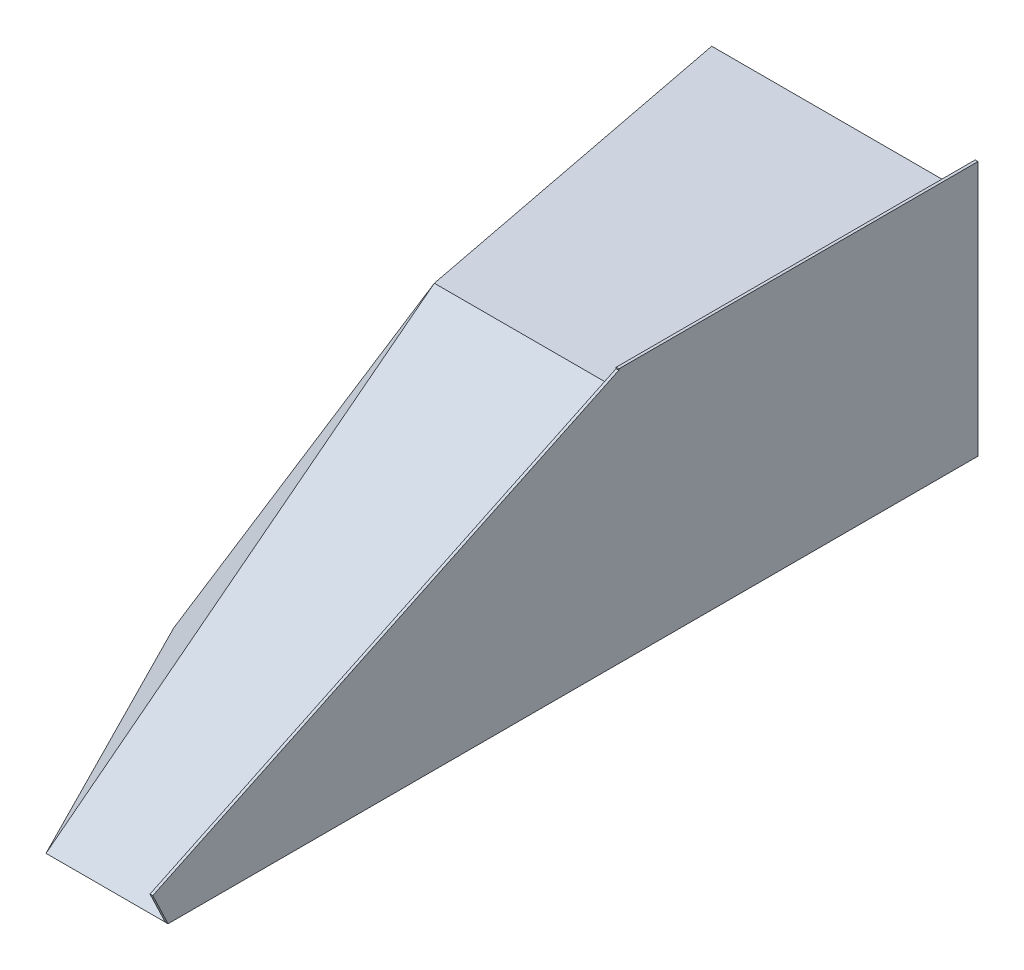
ISO-10303-21;
HEADER;
FILE_DESCRIPTION(('STEP AP214'),'2;1');
FILE_NAME('part.step','',(''),(''),'','','');
FILE_SCHEMA(('AUTOMOTIVE_DESIGN { 1 0 10303 214 1 1 1 1 }'));
ENDSEC;
DATA;
#1=APPLICATION_CONTEXT('core data for automotive mechanical design processes');
#2=APPLICATION_PROTOCOL_DEFINITION('international standard','automotive_design',2000,#1);
#3=PRODUCT_CONTEXT('',#1,'mechanical');
#4=PRODUCT('Part','Part','',(#3));
#5=PRODUCT_RELATED_PRODUCT_CATEGORY('part','',(#4));
#6=PRODUCT_DEFINITION_FORMATION('','',#4);
#7=PRODUCT_DEFINITION_CONTEXT('part definition',#1,'design');
#8=PRODUCT_DEFINITION('design','',#6,#7);
#9=PRODUCT_DEFINITION_SHAPE('','',#8);
#10=(LENGTH_UNIT() NAMED_UNIT(*) SI_UNIT(.MILLI.,.METRE.));
#11=(NAMED_UNIT(*) PLANE_ANGLE_UNIT() SI_UNIT($,.RADIAN.));
#12=(NAMED_UNIT(*) SI_UNIT($,.STERADIAN.) SOLID_ANGLE_UNIT());
#13=UNCERTAINTY_MEASURE_WITH_UNIT(LENGTH_MEASURE(1.E-05),#10,'distance_accuracy_value','');
#14=(GEOMETRIC_REPRESENTATION_CONTEXT(3) GLOBAL_UNCERTAINTY_ASSIGNED_CONTEXT((#13)) GLOBAL_UNIT_ASSIGNED_CONTEXT((#10,
#11,#12)) REPRESENTATION_CONTEXT('',''));
#15=CARTESIAN_POINT('',(0.,0.,0.));
#16=DIRECTION('',(0.,0.,1.));
#17=DIRECTION('',(1.,0.,0.));
#18=AXIS2_PLACEMENT_3D('',#15,#16,#17);
#19=CARTESIAN_POINT('',(508.,0.,0.));
#20=DIRECTION('',(0.,-0.90286051882393,-0.429933580392348));
#21=DIRECTION('',(0.,0.429933580392348,-0.90286051882393));
#22=AXIS2_PLACEMENT_3D('',#19,#20,#21);
#23=PLANE('',#22);
#24=DIRECTION('',(0.,-0.429933580392348,0.90286051882393));
#25=VECTOR('',#24,1.);
#26=CARTESIAN_POINT('',(-6.34999999999999,0.,0.));
#27=LINE('',#26,#25);
#28=CARTESIAN_POINT('',(-6.34999999999999,508.,-1066.8));
#29=VERTEX_POINT('',#28);
#30=CARTESIAN_POINT('',(-6.34999999999999,0.,0.));
#31=VERTEX_POINT('',#30);
#32=EDGE_CURVE('E236',#29,#31,#27,.T.);
#33=ORIENTED_EDGE('',*,*,#32,.F.);
#34=DIRECTION('',(-1.,0.,0.));
#35=VECTOR('',#34,1.);
#36=CARTESIAN_POINT('',(457.2,508.,-1066.8));
#37=LINE('',#36,#35);
#38=CARTESIAN_POINT('',(-457.2,508.,-1066.8));
#39=VERTEX_POINT('',#38);
#40=EDGE_CURVE('E11',#29,#39,#37,.T.);
#41=ORIENTED_EDGE('',*,*,#40,.T.);
#42=DIRECTION('',(0.148801508186848,-0.425147166248136,0.892809049121087));
#43=VECTOR('',#42,1.);
#44=CARTESIAN_POINT('',(-311.537370085856,91.8210573881609,-192.824220515138));
#45=LINE('',#44,#43);
#46=CARTESIAN_POINT('',(-279.4,0.,0.));
#47=VERTEX_POINT('',#46);
#48=EDGE_CURVE('E206',#39,#47,#45,.T.);
#49=ORIENTED_EDGE('',*,*,#48,.T.);
#50=DIRECTION('',(1.,0.,0.));
#51=VECTOR('',#50,1.);
#52=CARTESIAN_POINT('',(0.,0.,0.));
#53=LINE('',#52,#51);
#54=EDGE_CURVE('E43',#47,#31,#53,.T.);
#55=ORIENTED_EDGE('',*,*,#54,.T.);
#56=EDGE_LOOP('',(#33,#41,#49,#55));
#57=FACE_BOUND('',#56,.T.);
#58=ADVANCED_FACE('F39',(#57),#23,.F.);
#59=CARTESIAN_POINT('',(0.,584.2,-1032.08576463712));
#60=DIRECTION('',(0.,0.,-1.));
#61=DIRECTION('',(-1.,0.,0.));
#62=AXIS2_PLACEMENT_3D('',#59,#60,#61);
#63=PLANE('',#62);
#64=DIRECTION('',(-1.,0.,0.));
#65=VECTOR('',#64,1.);
#66=CARTESIAN_POINT('',(0.,580.899894262055,-1032.08576463712));
#67=LINE('',#66,#65);
#68=CARTESIAN_POINT('',(0.,580.899894262055,-1032.08576463712));
#69=VERTEX_POINT('',#68);
#70=CARTESIAN_POINT('',(-6.35,580.899894262055,-1032.08576463712));
#71=VERTEX_POINT('',#70);
#72=EDGE_CURVE('E146',#69,#71,#67,.T.);
#73=ORIENTED_EDGE('',*,*,#72,.F.);
#74=DIRECTION('',(0.,-1.,0.));
#75=VECTOR('',#74,1.);
#76=CARTESIAN_POINT('',(0.,584.2,-1032.08576463712));
#77=LINE('',#76,#75);
#78=CARTESIAN_POINT('',(0.,584.2,-1032.08576463712));
#79=VERTEX_POINT('',#78);
#80=EDGE_CURVE('E144',#79,#69,#77,.T.);
#81=ORIENTED_EDGE('',*,*,#80,.F.);
#82=DIRECTION('',(1.,0.,0.));
#83=VECTOR('',#82,1.);
#84=CARTESIAN_POINT('',(0.,584.2,-1032.08576463712));
#85=LINE('',#84,#83);
#86=CARTESIAN_POINT('',(-6.34999999999997,584.2,-1032.08576463712));
#87=VERTEX_POINT('',#86);
#88=EDGE_CURVE('E165',#87,#79,#85,.T.);
#89=ORIENTED_EDGE('',*,*,#88,.F.);
#90=DIRECTION('',(0.,-1.,0.));
#91=VECTOR('',#90,1.);
#92=CARTESIAN_POINT('',(-6.34999999999997,584.2,-1032.08576463712));
#93=LINE('',#92,#91);
#94=EDGE_CURVE('E172',#87,#71,#93,.T.);
#95=ORIENTED_EDGE('',*,*,#94,.T.);
#96=EDGE_LOOP('',(#73,#81,#89,#95));
#97=FACE_BOUND('',#96,.T.);
#98=ADVANCED_FACE('F254',(#97),#63,.F.);
#99=CARTESIAN_POINT('',(0.,508.,0.));
#100=DIRECTION('',(0.,-1.,0.));
#101=DIRECTION('',(0.,0.,-1.));
#102=AXIS2_PLACEMENT_3D('',#99,#100,#101);
#103=PLANE('',#102);
#104=DIRECTION('',(0.,0.,1.));
#105=VECTOR('',#104,1.);
#106=CARTESIAN_POINT('',(-6.34999999999997,508.,-1032.08576463712));
#107=LINE('',#106,#105);
#108=CARTESIAN_POINT('',(-6.35000000000004,508.,-1854.2));
#109=VERTEX_POINT('',#108);
#110=EDGE_CURVE('E55',#109,#29,#107,.T.);
#111=ORIENTED_EDGE('',*,*,#110,.F.);
#112=DIRECTION('',(1.,0.,0.));
#113=VECTOR('',#112,1.);
#114=CARTESIAN_POINT('',(0.,508.,-1854.2));
#115=LINE('',#114,#113);
#116=CARTESIAN_POINT('',(-609.6,508.,-1854.2));
#117=VERTEX_POINT('',#116);
#118=EDGE_CURVE('E210',#117,#109,#115,.T.);
#119=ORIENTED_EDGE('',*,*,#118,.F.);
#120=DIRECTION('',(0.190021906565861,0.,0.981779850590281));
#121=VECTOR('',#120,1.);
#122=CARTESIAN_POINT('',(-609.6,508.,-1854.2));
#123=LINE('',#122,#121);
#124=EDGE_CURVE('E202',#117,#39,#123,.T.);
#125=ORIENTED_EDGE('',*,*,#124,.T.);
#126=ORIENTED_EDGE('',*,*,#40,.F.);
#127=EDGE_LOOP('',(#111,#119,#125,#126));
#128=FACE_BOUND('',#127,.T.);
#129=ADVANCED_FACE('F258',(#128),#103,.F.);
#130=CARTESIAN_POINT('',(0.,0.,0.));
#131=DIRECTION('',(0.,1.,0.));
#132=DIRECTION('',(0.,0.,1.));
#133=AXIS2_PLACEMENT_3D('',#130,#131,#132);
#134=PLANE('',#133);
#135=DIRECTION('',(1.,0.,0.));
#136=VECTOR('',#135,1.);
#137=CARTESIAN_POINT('',(0.,0.,-1854.2));
#138=LINE('',#137,#136);
#139=CARTESIAN_POINT('',(-824.163316723663,0.,-1854.2));
#140=VERTEX_POINT('',#139);
#141=CARTESIAN_POINT('',(0.,0.,-1854.2));
#142=VERTEX_POINT('',#141);
#143=EDGE_CURVE('E209',#140,#142,#138,.T.);
#144=ORIENTED_EDGE('',*,*,#143,.T.);
#145=DIRECTION('',(0.,0.,1.));
#146=VECTOR('',#145,1.);
#147=CARTESIAN_POINT('',(0.,0.,0.));
#148=LINE('',#147,#146);
#149=CARTESIAN_POINT('',(0.,0.,0.));
#150=VERTEX_POINT('',#149);
#151=EDGE_CURVE('E183',#142,#150,#148,.T.);
#152=ORIENTED_EDGE('',*,*,#151,.T.);
#153=DIRECTION('',(1.,0.,0.));
#154=VECTOR('',#153,1.);
#155=CARTESIAN_POINT('',(0.,0.,0.));
#156=LINE('',#155,#154);
#157=EDGE_CURVE('E138',#31,#150,#156,.T.);
#158=ORIENTED_EDGE('',*,*,#157,.F.);
#159=ORIENTED_EDGE('',*,*,#54,.F.);
#160=DIRECTION('',(0.452240599485052,0.,0.891895980581481));
#161=VECTOR('',#160,1.);
#162=CARTESIAN_POINT('',(-279.4,0.,0.));
#163=LINE('',#162,#161);
#164=CARTESIAN_POINT('',(-580.045451773785,0.,-592.924364425635));
#165=VERTEX_POINT('',#164);
#166=EDGE_CURVE('E199',#165,#47,#163,.T.);
#167=ORIENTED_EDGE('',*,*,#166,.F.);
#168=DIRECTION('',(-0.190021906565861,0.,-0.981779850590281));
#169=VECTOR('',#168,1.);
#170=CARTESIAN_POINT('',(-448.48520298038,0.,86.8035876736221));
#171=LINE('',#170,#169);
#172=EDGE_CURVE('E191',#165,#140,#171,.T.);
#173=ORIENTED_EDGE('',*,*,#172,.T.);
#174=EDGE_LOOP('',(#144,#152,#158,#159,#167,#173));
#175=FACE_BOUND('',#174,.T.);
#176=ADVANCED_FACE('F41',(#175),#134,.F.);
#177=CARTESIAN_POINT('',(0.,508.,-1854.2));
#178=DIRECTION('',(0.,0.,-1.));
#179=DIRECTION('',(-1.,0.,0.));
#180=AXIS2_PLACEMENT_3D('',#177,#178,#179);
#181=PLANE('',#180);
#182=DIRECTION('',(0.,1.,0.));
#183=VECTOR('',#182,1.);
#184=CARTESIAN_POINT('',(0.,508.,-1854.2));
#185=LINE('',#184,#183);
#186=CARTESIAN_POINT('',(0.,584.2,-1854.2));
#187=VERTEX_POINT('',#186);
#188=EDGE_CURVE('E180',#142,#187,#185,.T.);
#189=ORIENTED_EDGE('',*,*,#188,.F.);
#190=ORIENTED_EDGE('',*,*,#143,.F.);
#191=DIRECTION('',(0.389086580250754,0.921201190331826,0.));
#192=VECTOR('',#191,1.);
#193=CARTESIAN_POINT('',(-596.562158471762,538.868386998671,-1854.2));
#194=LINE('',#193,#192);
#195=EDGE_CURVE('E195',#140,#117,#194,.T.);
#196=ORIENTED_EDGE('',*,*,#195,.T.);
#197=ORIENTED_EDGE('',*,*,#118,.T.);
#198=DIRECTION('',(0.,-1.,0.));
#199=VECTOR('',#198,1.);
#200=CARTESIAN_POINT('',(-6.35000000000011,584.2,-1854.2));
#201=LINE('',#200,#199);
#202=CARTESIAN_POINT('',(-6.35000000000011,584.2,-1854.2));
#203=VERTEX_POINT('',#202);
#204=EDGE_CURVE('E176',#203,#109,#201,.T.);
#205=ORIENTED_EDGE('',*,*,#204,.F.);
#206=DIRECTION('',(-1.,0.,0.));
#207=VECTOR('',#206,1.);
#208=CARTESIAN_POINT('',(0.,584.2,-1854.2));
#209=LINE('',#208,#207);
#210=EDGE_CURVE('E159',#187,#203,#209,.T.);
#211=ORIENTED_EDGE('',*,*,#210,.F.);
#212=EDGE_LOOP('',(#189,#190,#196,#197,#205,#211));
#213=FACE_BOUND('',#212,.T.);
#214=ADVANCED_FACE('F222',(#213),#181,.T.);
#215=CARTESIAN_POINT('',(-158.02566362996,112.959299077336,80.1277530227725));
#216=DIRECTION('',(0.752056744720598,-0.537582319217142,-0.381334371366358));
#217=DIRECTION('',(-0.581523906275312,-0.813529315040523,0.));
#218=AXIS2_PLACEMENT_3D('',#215,#216,#217);
#219=PLANE('',#218);
#220=ORIENTED_EDGE('',*,*,#166,.T.);
#221=ORIENTED_EDGE('',*,*,#48,.F.);
#222=DIRECTION('',(0.174128370510824,0.720069086337755,-0.671699204617629));
#223=VECTOR('',#222,1.);
#224=CARTESIAN_POINT('',(-631.807626871652,-214.050944255857,-393.252066680483));
#225=LINE('',#224,#223);
#226=EDGE_CURVE('E187',#165,#39,#225,.T.);
#227=ORIENTED_EDGE('',*,*,#226,.F.);
#228=EDGE_LOOP('',(#220,#221,#227));
#229=FACE_BOUND('',#228,.T.);
#230=ADVANCED_FACE('F264',(#229),#219,.F.);
#231=CARTESIAN_POINT('',(-382.681643927251,161.632761358848,74.0674149536616));
#232=DIRECTION('',(0.906898890852564,-0.383045736130585,-0.175528817584368));
#233=DIRECTION('',(-0.389086580250754,-0.921201190331826,0.));
#234=AXIS2_PLACEMENT_3D('',#231,#232,#233);
#235=PLANE('',#234);
#236=ORIENTED_EDGE('',*,*,#195,.F.);
#237=ORIENTED_EDGE('',*,*,#172,.F.);
#238=ORIENTED_EDGE('',*,*,#226,.T.);
#239=ORIENTED_EDGE('',*,*,#124,.F.);
#240=EDGE_LOOP('',(#236,#237,#238,#239));
#241=FACE_BOUND('',#240,.T.);
#242=ADVANCED_FACE('F269',(#241),#235,.F.);
#243=CARTESIAN_POINT('',(0.,0.,0.));
#244=DIRECTION('',(-1.,0.,0.));
#245=DIRECTION('',(0.,0.,1.));
#246=AXIS2_PLACEMENT_3D('',#243,#244,#245);
#247=PLANE('',#246);
#248=ORIENTED_EDGE('',*,*,#80,.T.);
#249=DIRECTION('',(0.,-0.90286051882393,-0.429933580392348));
#250=VECTOR('',#249,1.);
#251=CARTESIAN_POINT('',(0.,581.384502970009,-1031.85499858571));
#252=LINE('',#251,#250);
#253=CARTESIAN_POINT('',(0.,581.384502970009,-1031.85499858571));
#254=VERTEX_POINT('',#253);
#255=EDGE_CURVE('E120',#254,#69,#252,.T.);
#256=ORIENTED_EDGE('',*,*,#255,.F.);
#257=DIRECTION('',(0.,0.429933580392348,-0.90286051882393));
#258=VECTOR('',#257,1.);
#259=CARTESIAN_POINT('',(0.,73.3845029700091,34.94500141429));
#260=LINE('',#259,#258);
#261=CARTESIAN_POINT('',(0.,73.3845029700091,34.94500141429));
#262=VERTEX_POINT('',#261);
#263=EDGE_CURVE('E128',#262,#254,#260,.T.);
#264=ORIENTED_EDGE('',*,*,#263,.F.);
#265=DIRECTION('',(0.,-0.90286051882393,-0.429933580392348));
#266=VECTOR('',#265,1.);
#267=CARTESIAN_POINT('',(0.,73.3845029700091,34.94500141429));
#268=LINE('',#267,#266);
#269=EDGE_CURVE('E225',#262,#150,#268,.T.);
#270=ORIENTED_EDGE('',*,*,#269,.T.);
#271=ORIENTED_EDGE('',*,*,#151,.F.);
#272=ORIENTED_EDGE('',*,*,#188,.T.);
#273=DIRECTION('',(0.,0.,-1.));
#274=VECTOR('',#273,1.);
#275=CARTESIAN_POINT('',(0.,584.2,-1032.08576463712));
#276=LINE('',#275,#274);
#277=EDGE_CURVE('E155',#79,#187,#276,.T.);
#278=ORIENTED_EDGE('',*,*,#277,.F.);
#279=EDGE_LOOP('',(#248,#256,#264,#270,#271,#272,#278));
#280=FACE_BOUND('',#279,.T.);
#281=ADVANCED_FACE('F141',(#280),#247,.F.);
#282=CARTESIAN_POINT('',(-6.34999999999997,584.2,-1032.08576463712));
#283=DIRECTION('',(1.,0.,0.));
#284=DIRECTION('',(0.,0.,-1.));
#285=AXIS2_PLACEMENT_3D('',#282,#283,#284);
#286=PLANE('',#285);
#287=DIRECTION('',(0.,-0.90286051882393,-0.429933580392348));
#288=VECTOR('',#287,1.);
#289=CARTESIAN_POINT('',(-6.35,581.384502970009,-1031.85499858571));
#290=LINE('',#289,#288);
#291=CARTESIAN_POINT('',(-6.35,581.384502970009,-1031.85499858571));
#292=VERTEX_POINT('',#291);
#293=EDGE_CURVE('E123',#292,#71,#290,.T.);
#294=ORIENTED_EDGE('',*,*,#293,.T.);
#295=ORIENTED_EDGE('',*,*,#94,.F.);
#296=DIRECTION('',(0.,0.,1.));
#297=VECTOR('',#296,1.);
#298=CARTESIAN_POINT('',(-6.34999999999997,584.2,-1032.08576463712));
#299=LINE('',#298,#297);
#300=EDGE_CURVE('E162',#203,#87,#299,.T.);
#301=ORIENTED_EDGE('',*,*,#300,.F.);
#302=ORIENTED_EDGE('',*,*,#204,.T.);
#303=ORIENTED_EDGE('',*,*,#110,.T.);
#304=ORIENTED_EDGE('',*,*,#32,.T.);
#305=DIRECTION('',(0.,-0.90286051882393,-0.429933580392348));
#306=VECTOR('',#305,1.);
#307=CARTESIAN_POINT('',(-6.35,73.3845029700091,34.94500141429));
#308=LINE('',#307,#306);
#309=CARTESIAN_POINT('',(-6.35,73.3845029700091,34.94500141429));
#310=VERTEX_POINT('',#309);
#311=EDGE_CURVE('E151',#310,#31,#308,.T.);
#312=ORIENTED_EDGE('',*,*,#311,.F.);
#313=DIRECTION('',(0.,-0.429933580392348,0.90286051882393));
#314=VECTOR('',#313,1.);
#315=CARTESIAN_POINT('',(-6.35,73.3845029700091,34.94500141429));
#316=LINE('',#315,#314);
#317=EDGE_CURVE('E127',#292,#310,#316,.T.);
#318=ORIENTED_EDGE('',*,*,#317,.F.);
#319=EDGE_LOOP('',(#294,#295,#301,#302,#303,#304,#312,#318));
#320=FACE_BOUND('',#319,.T.);
#321=ADVANCED_FACE('F242',(#320),#286,.F.);
#322=CARTESIAN_POINT('',(0.,584.2,0.));
#323=DIRECTION('',(0.,1.,0.));
#324=DIRECTION('',(0.,0.,1.));
#325=AXIS2_PLACEMENT_3D('',#322,#323,#324);
#326=PLANE('',#325);
#327=ORIENTED_EDGE('',*,*,#277,.T.);
#328=ORIENTED_EDGE('',*,*,#210,.T.);
#329=ORIENTED_EDGE('',*,*,#300,.T.);
#330=ORIENTED_EDGE('',*,*,#88,.T.);
#331=EDGE_LOOP('',(#327,#328,#329,#330));
#332=FACE_BOUND('',#331,.T.);
#333=ADVANCED_FACE('F251',(#332),#326,.T.);
#334=CARTESIAN_POINT('',(0.,581.384502970009,-1031.85499858571));
#335=DIRECTION('',(0.,-0.429933580392348,0.90286051882393));
#336=DIRECTION('',(0.,-0.90286051882393,-0.429933580392348));
#337=AXIS2_PLACEMENT_3D('',#334,#335,#336);
#338=PLANE('',#337);
#339=ORIENTED_EDGE('',*,*,#255,.T.);
#340=ORIENTED_EDGE('',*,*,#72,.T.);
#341=ORIENTED_EDGE('',*,*,#293,.F.);
#342=DIRECTION('',(-1.,0.,0.));
#343=VECTOR('',#342,1.);
#344=CARTESIAN_POINT('',(0.,581.384502970009,-1031.85499858571));
#345=LINE('',#344,#343);
#346=EDGE_CURVE('E116',#254,#292,#345,.T.);
#347=ORIENTED_EDGE('',*,*,#346,.F.);
#348=EDGE_LOOP('',(#339,#340,#341,#347));
#349=FACE_BOUND('',#348,.T.);
#350=ADVANCED_FACE('F118',(#349),#338,.F.);
#351=CARTESIAN_POINT('',(0.,73.3845029700091,34.94500141429));
#352=DIRECTION('',(0.,0.429933580392348,-0.90286051882393));
#353=DIRECTION('',(0.,0.90286051882393,0.429933580392348));
#354=AXIS2_PLACEMENT_3D('',#351,#352,#353);
#355=PLANE('',#354);
#356=ORIENTED_EDGE('',*,*,#157,.T.);
#357=ORIENTED_EDGE('',*,*,#269,.F.);
#358=DIRECTION('',(1.,0.,0.));
#359=VECTOR('',#358,1.);
#360=CARTESIAN_POINT('',(0.,73.3845029700091,34.94500141429));
#361=LINE('',#360,#359);
#362=EDGE_CURVE('E133',#310,#262,#361,.T.);
#363=ORIENTED_EDGE('',*,*,#362,.F.);
#364=ORIENTED_EDGE('',*,*,#311,.T.);
#365=EDGE_LOOP('',(#356,#357,#363,#364));
#366=FACE_BOUND('',#365,.T.);
#367=ADVANCED_FACE('F243',(#366),#355,.F.);
#368=CARTESIAN_POINT('',(0.,73.3845029700091,34.94500141429));
#369=DIRECTION('',(0.,0.90286051882393,0.429933580392348));
#370=DIRECTION('',(0.,-0.429933580392348,0.90286051882393));
#371=AXIS2_PLACEMENT_3D('',#368,#369,#370);
#372=PLANE('',#371);
#373=ORIENTED_EDGE('',*,*,#263,.T.);
#374=ORIENTED_EDGE('',*,*,#346,.T.);
#375=ORIENTED_EDGE('',*,*,#317,.T.);
#376=ORIENTED_EDGE('',*,*,#362,.T.);
#377=EDGE_LOOP('',(#373,#374,#375,#376));
#378=FACE_BOUND('',#377,.T.);
#379=ADVANCED_FACE('F131',(#378),#372,.T.);
#380=CLOSED_SHELL('',(#58,#98,#129,#176,#214,#230,#242,#281,#321,#333,#350,#367,#379));
#381=MANIFOLD_SOLID_BREP('B2',#380);
#382=ADVANCED_BREP_SHAPE_REPRESENTATION('',(#18,#381),#14);
#383=SHAPE_DEFINITION_REPRESENTATION(#9,#382);
ENDSEC;
END-ISO-10303-21;
